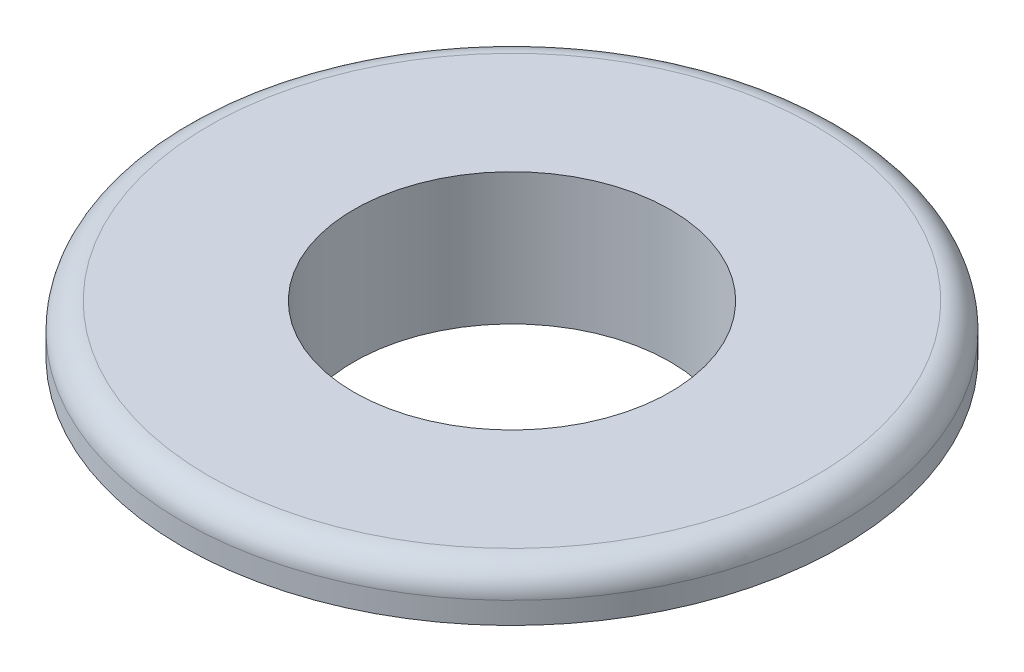
ISO-10303-21;
HEADER;
FILE_DESCRIPTION(('STEP AP214'),'2;1');
FILE_NAME('part.step','',(''),(''),'','','');
FILE_SCHEMA(('AUTOMOTIVE_DESIGN { 1 0 10303 214 1 1 1 1 }'));
ENDSEC;
DATA;
#1=APPLICATION_CONTEXT('core data for automotive mechanical design processes');
#2=APPLICATION_PROTOCOL_DEFINITION('international standard','automotive_design',2000,#1);
#3=PRODUCT_CONTEXT('',#1,'mechanical');
#4=PRODUCT('Part','Part','',(#3));
#5=PRODUCT_RELATED_PRODUCT_CATEGORY('part','',(#4));
#6=PRODUCT_DEFINITION_FORMATION('','',#4);
#7=PRODUCT_DEFINITION_CONTEXT('part definition',#1,'design');
#8=PRODUCT_DEFINITION('design','',#6,#7);
#9=PRODUCT_DEFINITION_SHAPE('','',#8);
#10=(LENGTH_UNIT() NAMED_UNIT(*) SI_UNIT(.MILLI.,.METRE.));
#11=(NAMED_UNIT(*) PLANE_ANGLE_UNIT() SI_UNIT($,.RADIAN.));
#12=(NAMED_UNIT(*) SI_UNIT($,.STERADIAN.) SOLID_ANGLE_UNIT());
#13=UNCERTAINTY_MEASURE_WITH_UNIT(LENGTH_MEASURE(1.E-05),#10,'distance_accuracy_value','');
#14=(GEOMETRIC_REPRESENTATION_CONTEXT(3) GLOBAL_UNCERTAINTY_ASSIGNED_CONTEXT((#13)) GLOBAL_UNIT_ASSIGNED_CONTEXT((#10,
#11,#12)) REPRESENTATION_CONTEXT('',''));
#15=CARTESIAN_POINT('',(0.,0.,0.));
#16=DIRECTION('',(0.,0.,1.));
#17=DIRECTION('',(1.,0.,0.));
#18=AXIS2_PLACEMENT_3D('',#15,#16,#17);
#19=CARTESIAN_POINT('',(0.,0.,0.));
#20=DIRECTION('',(0.,1.,0.));
#21=DIRECTION('',(0.,0.,1.));
#22=AXIS2_PLACEMENT_3D('',#19,#20,#21);
#23=PLANE('',#22);
#24=CARTESIAN_POINT('',(0.,0.,0.));
#25=DIRECTION('',(0.,1.,0.));
#26=DIRECTION('',(0.,0.,1.));
#27=AXIS2_PLACEMENT_3D('',#24,#25,#26);
#28=CIRCLE('',#27,7.);
#29=CARTESIAN_POINT('',(0.,0.,7.));
#30=VERTEX_POINT('',#29);
#31=EDGE_CURVE('E52',#30,#30,#28,.T.);
#32=ORIENTED_EDGE('',*,*,#31,.F.);
#33=EDGE_LOOP('',(#32));
#34=FACE_BOUND('',#33,.T.);
#35=CARTESIAN_POINT('',(0.,0.,0.));
#36=DIRECTION('',(0.,1.,0.));
#37=DIRECTION('',(0.,0.,1.));
#38=AXIS2_PLACEMENT_3D('',#35,#36,#37);
#39=CIRCLE('',#38,6.);
#40=CARTESIAN_POINT('',(0.,0.,6.));
#41=VERTEX_POINT('',#40);
#42=EDGE_CURVE('E56',#41,#41,#39,.T.);
#43=ORIENTED_EDGE('',*,*,#42,.T.);
#44=EDGE_LOOP('',(#43));
#45=FACE_BOUND('',#44,.T.);
#46=ADVANCED_FACE('F37',(#34,#45),#23,.F.);
#47=CARTESIAN_POINT('',(0.,3.175,0.));
#48=DIRECTION('',(0.,-1.,0.));
#49=DIRECTION('',(0.,0.,-1.));
#50=AXIS2_PLACEMENT_3D('',#47,#48,#49);
#51=CYLINDRICAL_SURFACE('',#50,7.);
#52=CARTESIAN_POINT('',(0.,3.175,0.));
#53=DIRECTION('',(0.,1.,0.));
#54=DIRECTION('',(0.,0.,1.));
#55=AXIS2_PLACEMENT_3D('',#52,#53,#54);
#56=CIRCLE('',#55,7.);
#57=CARTESIAN_POINT('',(0.,3.175,7.));
#58=VERTEX_POINT('',#57);
#59=EDGE_CURVE('E48',#58,#58,#56,.T.);
#60=ORIENTED_EDGE('',*,*,#59,.F.);
#61=EDGE_LOOP('',(#60));
#62=FACE_BOUND('',#61,.T.);
#63=ORIENTED_EDGE('',*,*,#31,.T.);
#64=EDGE_LOOP('',(#63));
#65=FACE_BOUND('',#64,.T.);
#66=ADVANCED_FACE('F81',(#62,#65),#51,.T.);
#67=CARTESIAN_POINT('',(0.,3.175,0.));
#68=DIRECTION('',(0.,-1.,0.));
#69=DIRECTION('',(0.,0.,-1.));
#70=AXIS2_PLACEMENT_3D('',#67,#68,#69);
#71=CYLINDRICAL_SURFACE('',#70,6.);
#72=ORIENTED_EDGE('',*,*,#42,.F.);
#73=EDGE_LOOP('',(#72));
#74=FACE_BOUND('',#73,.T.);
#75=CARTESIAN_POINT('',(0.,5.,0.));
#76=DIRECTION('',(0.,1.,0.));
#77=DIRECTION('',(0.,0.,1.));
#78=AXIS2_PLACEMENT_3D('',#75,#76,#77);
#79=CIRCLE('',#78,6.);
#80=CARTESIAN_POINT('',(0.,5.,6.));
#81=VERTEX_POINT('',#80);
#82=EDGE_CURVE('E63',#81,#81,#79,.T.);
#83=ORIENTED_EDGE('',*,*,#82,.T.);
#84=EDGE_LOOP('',(#83));
#85=FACE_BOUND('',#84,.T.);
#86=ADVANCED_FACE('F67',(#74,#85),#71,.F.);
#87=CARTESIAN_POINT('',(0.,5.,0.));
#88=DIRECTION('',(0.,1.,0.));
#89=DIRECTION('',(0.,0.,1.));
#90=AXIS2_PLACEMENT_3D('',#87,#88,#89);
#91=PLANE('',#90);
#92=CARTESIAN_POINT('',(0.,5.,0.));
#93=DIRECTION('',(0.,1.,0.));
#94=DIRECTION('',(0.,0.,1.));
#95=AXIS2_PLACEMENT_3D('',#92,#93,#94);
#96=CIRCLE('',#95,11.5);
#97=CARTESIAN_POINT('',(0.,5.,11.5));
#98=VERTEX_POINT('',#97);
#99=EDGE_CURVE('E44',#98,#98,#96,.T.);
#100=ORIENTED_EDGE('',*,*,#99,.T.);
#101=EDGE_LOOP('',(#100));
#102=FACE_BOUND('',#101,.T.);
#103=ORIENTED_EDGE('',*,*,#82,.F.);
#104=EDGE_LOOP('',(#103));
#105=FACE_BOUND('',#104,.T.);
#106=ADVANCED_FACE('F69',(#102,#105),#91,.T.);
#107=CARTESIAN_POINT('',(0.,3.175,0.));
#108=DIRECTION('',(0.,1.,0.));
#109=DIRECTION('',(0.,0.,1.));
#110=AXIS2_PLACEMENT_3D('',#107,#108,#109);
#111=PLANE('',#110);
#112=ORIENTED_EDGE('',*,*,#59,.T.);
#113=EDGE_LOOP('',(#112));
#114=FACE_BOUND('',#113,.T.);
#115=CARTESIAN_POINT('',(0.,3.175,0.));
#116=DIRECTION('',(0.,1.,0.));
#117=DIRECTION('',(0.,0.,1.));
#118=AXIS2_PLACEMENT_3D('',#115,#116,#117);
#119=CIRCLE('',#118,12.5);
#120=CARTESIAN_POINT('',(0.,3.175,12.5));
#121=VERTEX_POINT('',#120);
#122=EDGE_CURVE('E60',#121,#121,#119,.T.);
#123=ORIENTED_EDGE('',*,*,#122,.F.);
#124=EDGE_LOOP('',(#123));
#125=FACE_BOUND('',#124,.T.);
#126=ADVANCED_FACE('F71',(#114,#125),#111,.F.);
#127=CARTESIAN_POINT('',(0.,5.,0.));
#128=DIRECTION('',(0.,-1.,0.));
#129=DIRECTION('',(0.,0.,-1.));
#130=AXIS2_PLACEMENT_3D('',#127,#128,#129);
#131=CYLINDRICAL_SURFACE('',#130,12.5);
#132=CARTESIAN_POINT('',(0.,4.,0.));
#133=DIRECTION('',(0.,1.,0.));
#134=DIRECTION('',(0.,0.,1.));
#135=AXIS2_PLACEMENT_3D('',#132,#133,#134);
#136=CIRCLE('',#135,12.5);
#137=CARTESIAN_POINT('',(0.,4.,12.5));
#138=VERTEX_POINT('',#137);
#139=EDGE_CURVE('E10',#138,#138,#136,.F.);
#140=ORIENTED_EDGE('',*,*,#139,.T.);
#141=EDGE_LOOP('',(#140));
#142=FACE_BOUND('',#141,.T.);
#143=ORIENTED_EDGE('',*,*,#122,.T.);
#144=EDGE_LOOP('',(#143));
#145=FACE_BOUND('',#144,.T.);
#146=ADVANCED_FACE('F77',(#142,#145),#131,.T.);
#147=CARTESIAN_POINT('',(0.,4.,0.));
#148=DIRECTION('',(0.,1.,0.));
#149=DIRECTION('',(0.,0.,1.));
#150=AXIS2_PLACEMENT_3D('',#147,#148,#149);
#151=TOROIDAL_SURFACE('',#150,11.5,1.);
#152=ORIENTED_EDGE('',*,*,#139,.F.);
#153=EDGE_LOOP('',(#152));
#154=FACE_BOUND('',#153,.T.);
#155=ORIENTED_EDGE('',*,*,#99,.F.);
#156=EDGE_LOOP('',(#155));
#157=FACE_BOUND('',#156,.T.);
#158=ADVANCED_FACE('F39',(#154,#157),#151,.T.);
#159=CLOSED_SHELL('',(#46,#66,#86,#106,#126,#146,#158));
#160=MANIFOLD_SOLID_BREP('B2',#159);
#161=ADVANCED_BREP_SHAPE_REPRESENTATION('',(#18,#160),#14);
#162=SHAPE_DEFINITION_REPRESENTATION(#9,#161);
ENDSEC;
END-ISO-10303-21;
